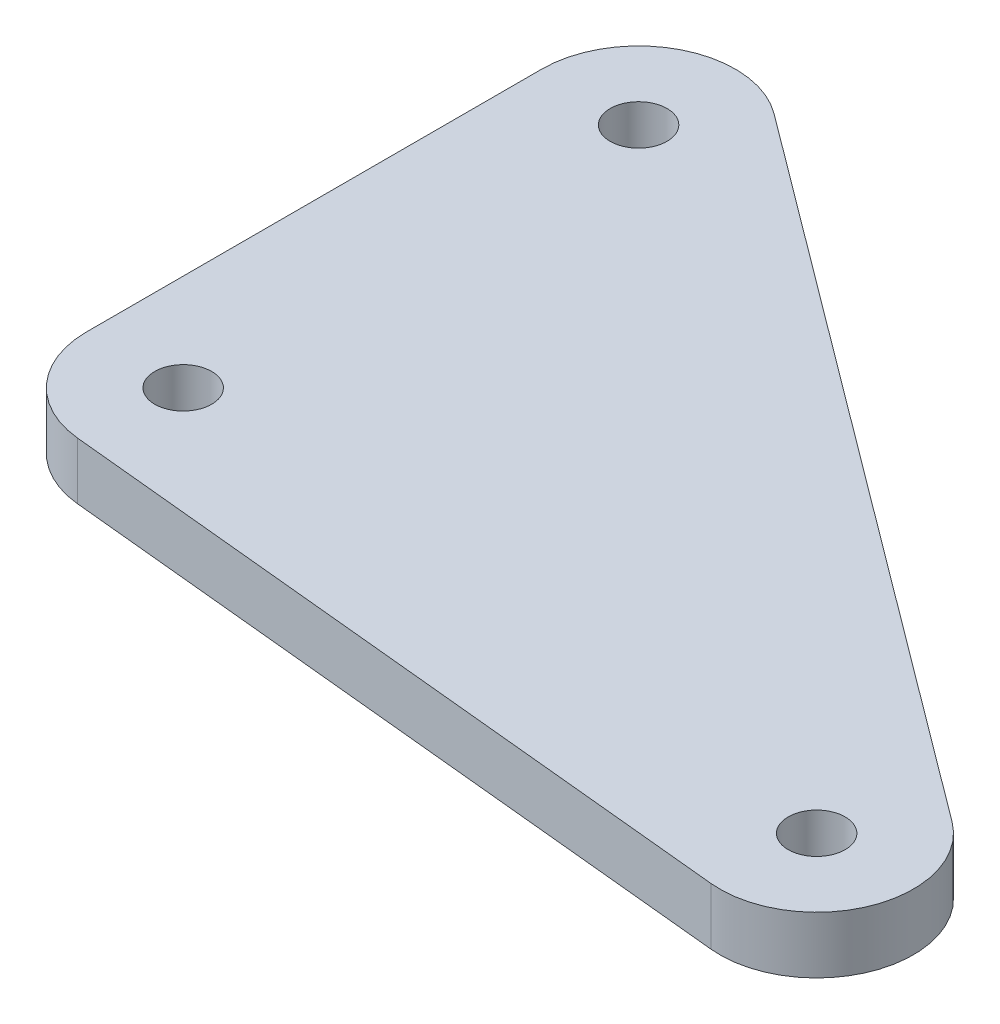
ISO-10303-21;
HEADER;
FILE_DESCRIPTION(('STEP AP214'),'2;1');
FILE_NAME('part.step','',(''),(''),'','','');
FILE_SCHEMA(('AUTOMOTIVE_DESIGN { 1 0 10303 214 1 1 1 1 }'));
ENDSEC;
DATA;
#1=APPLICATION_CONTEXT('core data for automotive mechanical design processes');
#2=APPLICATION_PROTOCOL_DEFINITION('international standard','automotive_design',2000,#1);
#3=PRODUCT_CONTEXT('',#1,'mechanical');
#4=PRODUCT('Part','Part','',(#3));
#5=PRODUCT_RELATED_PRODUCT_CATEGORY('part','',(#4));
#6=PRODUCT_DEFINITION_FORMATION('','',#4);
#7=PRODUCT_DEFINITION_CONTEXT('part definition',#1,'design');
#8=PRODUCT_DEFINITION('design','',#6,#7);
#9=PRODUCT_DEFINITION_SHAPE('','',#8);
#10=(LENGTH_UNIT() NAMED_UNIT(*) SI_UNIT(.MILLI.,.METRE.));
#11=(NAMED_UNIT(*) PLANE_ANGLE_UNIT() SI_UNIT($,.RADIAN.));
#12=(NAMED_UNIT(*) SI_UNIT($,.STERADIAN.) SOLID_ANGLE_UNIT());
#13=UNCERTAINTY_MEASURE_WITH_UNIT(LENGTH_MEASURE(1.E-05),#10,'distance_accuracy_value','');
#14=(GEOMETRIC_REPRESENTATION_CONTEXT(3) GLOBAL_UNCERTAINTY_ASSIGNED_CONTEXT((#13)) GLOBAL_UNIT_ASSIGNED_CONTEXT((#10,
#11,#12)) REPRESENTATION_CONTEXT('',''));
#15=CARTESIAN_POINT('',(0.,0.,0.));
#16=DIRECTION('',(0.,0.,1.));
#17=DIRECTION('',(1.,0.,0.));
#18=AXIS2_PLACEMENT_3D('',#15,#16,#17);
#19=CARTESIAN_POINT('',(0.,2.5,0.));
#20=DIRECTION('',(0.,1.,0.));
#21=DIRECTION('',(0.,0.,1.));
#22=AXIS2_PLACEMENT_3D('',#19,#20,#21);
#23=PLANE('',#22);
#24=CARTESIAN_POINT('',(0.,2.5,20.));
#25=DIRECTION('',(0.,1.,0.));
#26=DIRECTION('',(0.,0.,1.));
#27=AXIS2_PLACEMENT_3D('',#24,#25,#26);
#28=CIRCLE('',#27,1.25);
#29=CARTESIAN_POINT('',(0.,2.5,21.25));
#30=VERTEX_POINT('',#29);
#31=EDGE_CURVE('E184',#30,#30,#28,.T.);
#32=ORIENTED_EDGE('',*,*,#31,.F.);
#33=EDGE_LOOP('',(#32));
#34=FACE_BOUND('',#33,.T.);
#35=CARTESIAN_POINT('',(0.,2.5,0.));
#36=DIRECTION('',(0.,1.,0.));
#37=DIRECTION('',(0.,0.,1.));
#38=AXIS2_PLACEMENT_3D('',#35,#36,#37);
#39=CIRCLE('',#38,4.25);
#40=CARTESIAN_POINT('',(2.54241071428571,2.5,-3.40567875171532));
#41=VERTEX_POINT('',#40);
#42=CARTESIAN_POINT('',(-4.25,2.5,0.));
#43=VERTEX_POINT('',#42);
#44=EDGE_CURVE('E129',#41,#43,#39,.T.);
#45=ORIENTED_EDGE('',*,*,#44,.T.);
#46=DIRECTION('',(0.,0.,1.));
#47=VECTOR('',#46,1.);
#48=CARTESIAN_POINT('',(-4.25,2.5,20.));
#49=LINE('',#48,#47);
#50=CARTESIAN_POINT('',(-4.25,2.5,20.));
#51=VERTEX_POINT('',#50);
#52=EDGE_CURVE('E87',#43,#51,#49,.T.);
#53=ORIENTED_EDGE('',*,*,#52,.T.);
#54=CARTESIAN_POINT('',(0.,2.5,20.));
#55=DIRECTION('',(0.,1.,0.));
#56=DIRECTION('',(0.,0.,1.));
#57=AXIS2_PLACEMENT_3D('',#54,#55,#56);
#58=CIRCLE('',#57,4.25);
#59=CARTESIAN_POINT('',(-0.415574596774195,2.5,24.2296332884206));
#60=VERTEX_POINT('',#59);
#61=EDGE_CURVE('E100',#51,#60,#58,.T.);
#62=ORIENTED_EDGE('',*,*,#61,.T.);
#63=DIRECTION('',(0.995207832569562,0.,0.0977822580645162));
#64=VECTOR('',#63,1.);
#65=CARTESIAN_POINT('',(30.4358682128822,2.5,27.2608832884206));
#66=LINE('',#65,#64);
#67=CARTESIAN_POINT('',(30.4358682128822,2.5,27.2608832884206));
#68=VERTEX_POINT('',#67);
#69=EDGE_CURVE('E94',#60,#68,#66,.T.);
#70=ORIENTED_EDGE('',*,*,#69,.T.);
#71=CARTESIAN_POINT('',(30.8514428096564,2.5,23.03125));
#72=DIRECTION('',(0.,1.,0.));
#73=DIRECTION('',(0.,0.,1.));
#74=AXIS2_PLACEMENT_3D('',#71,#72,#73);
#75=CIRCLE('',#74,4.25);
#76=CARTESIAN_POINT('',(33.3938535239421,2.5,19.6255712482847));
#77=VERTEX_POINT('',#76);
#78=EDGE_CURVE('E98',#68,#77,#75,.T.);
#79=ORIENTED_EDGE('',*,*,#78,.T.);
#80=DIRECTION('',(-0.801336176874192,0.,-0.598214285714286));
#81=VECTOR('',#80,1.);
#82=CARTESIAN_POINT('',(2.54241071428571,2.5,-3.40567875171532));
#83=LINE('',#82,#81);
#84=EDGE_CURVE('E50',#77,#41,#83,.T.);
#85=ORIENTED_EDGE('',*,*,#84,.T.);
#86=EDGE_LOOP('',(#45,#53,#62,#70,#79,#85));
#87=FACE_BOUND('',#86,.T.);
#88=CARTESIAN_POINT('',(0.,2.5,0.));
#89=DIRECTION('',(0.,1.,0.));
#90=DIRECTION('',(0.,0.,1.));
#91=AXIS2_PLACEMENT_3D('',#88,#89,#90);
#92=CIRCLE('',#91,1.25);
#93=CARTESIAN_POINT('',(0.,2.5,1.25));
#94=VERTEX_POINT('',#93);
#95=EDGE_CURVE('E122',#94,#94,#92,.T.);
#96=ORIENTED_EDGE('',*,*,#95,.F.);
#97=EDGE_LOOP('',(#96));
#98=FACE_BOUND('',#97,.T.);
#99=CARTESIAN_POINT('',(30.8514428096564,2.5,23.03125));
#100=DIRECTION('',(0.,1.,0.));
#101=DIRECTION('',(0.,0.,1.));
#102=AXIS2_PLACEMENT_3D('',#99,#100,#101);
#103=CIRCLE('',#102,1.25);
#104=CARTESIAN_POINT('',(30.8514428096564,2.5,24.28125));
#105=VERTEX_POINT('',#104);
#106=EDGE_CURVE('E175',#105,#105,#103,.T.);
#107=ORIENTED_EDGE('',*,*,#106,.F.);
#108=EDGE_LOOP('',(#107));
#109=FACE_BOUND('',#108,.T.);
#110=ADVANCED_FACE('F33',(#34,#87,#98,#109),#23,.T.);
#111=CARTESIAN_POINT('',(0.,0.,0.));
#112=DIRECTION('',(0.,1.,0.));
#113=DIRECTION('',(0.,0.,1.));
#114=AXIS2_PLACEMENT_3D('',#111,#112,#113);
#115=PLANE('',#114);
#116=CARTESIAN_POINT('',(0.,0.,0.));
#117=DIRECTION('',(0.,1.,0.));
#118=DIRECTION('',(0.,0.,1.));
#119=AXIS2_PLACEMENT_3D('',#116,#117,#118);
#120=CIRCLE('',#119,4.25);
#121=CARTESIAN_POINT('',(2.54241071428571,0.,-3.40567875171532));
#122=VERTEX_POINT('',#121);
#123=CARTESIAN_POINT('',(-4.25,0.,0.));
#124=VERTEX_POINT('',#123);
#125=EDGE_CURVE('E118',#122,#124,#120,.T.);
#126=ORIENTED_EDGE('',*,*,#125,.F.);
#127=DIRECTION('',(-0.801336176874192,0.,-0.598214285714286));
#128=VECTOR('',#127,1.);
#129=CARTESIAN_POINT('',(2.54241071428571,0.,-3.40567875171532));
#130=LINE('',#129,#128);
#131=CARTESIAN_POINT('',(33.3938535239421,0.,19.6255712482847));
#132=VERTEX_POINT('',#131);
#133=EDGE_CURVE('E79',#132,#122,#130,.T.);
#134=ORIENTED_EDGE('',*,*,#133,.F.);
#135=CARTESIAN_POINT('',(30.8514428096564,0.,23.03125));
#136=DIRECTION('',(0.,1.,0.));
#137=DIRECTION('',(0.,0.,1.));
#138=AXIS2_PLACEMENT_3D('',#135,#136,#137);
#139=CIRCLE('',#138,4.25);
#140=CARTESIAN_POINT('',(30.4358682128822,0.,27.2608832884206));
#141=VERTEX_POINT('',#140);
#142=EDGE_CURVE('E73',#141,#132,#139,.T.);
#143=ORIENTED_EDGE('',*,*,#142,.F.);
#144=DIRECTION('',(0.995207832569562,0.,0.0977822580645162));
#145=VECTOR('',#144,1.);
#146=CARTESIAN_POINT('',(30.4358682128822,0.,27.2608832884206));
#147=LINE('',#146,#145);
#148=CARTESIAN_POINT('',(-0.415574596774195,0.,24.2296332884206));
#149=VERTEX_POINT('',#148);
#150=EDGE_CURVE('E108',#149,#141,#147,.T.);
#151=ORIENTED_EDGE('',*,*,#150,.F.);
#152=CARTESIAN_POINT('',(0.,0.,20.));
#153=DIRECTION('',(0.,1.,0.));
#154=DIRECTION('',(0.,0.,1.));
#155=AXIS2_PLACEMENT_3D('',#152,#153,#154);
#156=CIRCLE('',#155,4.25);
#157=CARTESIAN_POINT('',(-4.25,0.,20.));
#158=VERTEX_POINT('',#157);
#159=EDGE_CURVE('E124',#158,#149,#156,.T.);
#160=ORIENTED_EDGE('',*,*,#159,.F.);
#161=DIRECTION('',(0.,0.,1.));
#162=VECTOR('',#161,1.);
#163=CARTESIAN_POINT('',(-4.25,0.,20.));
#164=LINE('',#163,#162);
#165=EDGE_CURVE('E121',#124,#158,#164,.T.);
#166=ORIENTED_EDGE('',*,*,#165,.F.);
#167=EDGE_LOOP('',(#126,#134,#143,#151,#160,#166));
#168=FACE_BOUND('',#167,.T.);
#169=CARTESIAN_POINT('',(0.,0.,0.));
#170=DIRECTION('',(0.,1.,0.));
#171=DIRECTION('',(0.,0.,1.));
#172=AXIS2_PLACEMENT_3D('',#169,#170,#171);
#173=CIRCLE('',#172,1.25);
#174=CARTESIAN_POINT('',(0.,0.,1.25));
#175=VERTEX_POINT('',#174);
#176=EDGE_CURVE('E187',#175,#175,#173,.T.);
#177=ORIENTED_EDGE('',*,*,#176,.T.);
#178=EDGE_LOOP('',(#177));
#179=FACE_BOUND('',#178,.T.);
#180=CARTESIAN_POINT('',(0.,0.,20.));
#181=DIRECTION('',(0.,1.,0.));
#182=DIRECTION('',(0.,0.,1.));
#183=AXIS2_PLACEMENT_3D('',#180,#181,#182);
#184=CIRCLE('',#183,1.25);
#185=CARTESIAN_POINT('',(0.,0.,21.25));
#186=VERTEX_POINT('',#185);
#187=EDGE_CURVE('E181',#186,#186,#184,.T.);
#188=ORIENTED_EDGE('',*,*,#187,.T.);
#189=EDGE_LOOP('',(#188));
#190=FACE_BOUND('',#189,.T.);
#191=CARTESIAN_POINT('',(30.8514428096564,0.,23.03125));
#192=DIRECTION('',(0.,1.,0.));
#193=DIRECTION('',(0.,0.,1.));
#194=AXIS2_PLACEMENT_3D('',#191,#192,#193);
#195=CIRCLE('',#194,1.25);
#196=CARTESIAN_POINT('',(30.8514428096564,0.,24.28125));
#197=VERTEX_POINT('',#196);
#198=EDGE_CURVE('E178',#197,#197,#195,.T.);
#199=ORIENTED_EDGE('',*,*,#198,.T.);
#200=EDGE_LOOP('',(#199));
#201=FACE_BOUND('',#200,.T.);
#202=ADVANCED_FACE('F138',(#168,#179,#190,#201),#115,.F.);
#203=CARTESIAN_POINT('',(0.,2.5,0.));
#204=DIRECTION('',(0.,-1.,0.));
#205=DIRECTION('',(0.,0.,-1.));
#206=AXIS2_PLACEMENT_3D('',#203,#204,#205);
#207=CYLINDRICAL_SURFACE('',#206,4.25);
#208=ORIENTED_EDGE('',*,*,#125,.T.);
#209=DIRECTION('',(0.,-1.,0.));
#210=VECTOR('',#209,1.);
#211=CARTESIAN_POINT('',(-4.25,2.5,0.));
#212=LINE('',#211,#210);
#213=EDGE_CURVE('E11',#43,#124,#212,.T.);
#214=ORIENTED_EDGE('',*,*,#213,.F.);
#215=ORIENTED_EDGE('',*,*,#44,.F.);
#216=DIRECTION('',(0.,-1.,0.));
#217=VECTOR('',#216,1.);
#218=CARTESIAN_POINT('',(2.54241071428571,2.5,-3.40567875171532));
#219=LINE('',#218,#217);
#220=EDGE_CURVE('E114',#41,#122,#219,.T.);
#221=ORIENTED_EDGE('',*,*,#220,.T.);
#222=EDGE_LOOP('',(#208,#214,#215,#221));
#223=FACE_BOUND('',#222,.T.);
#224=ADVANCED_FACE('F35',(#223),#207,.T.);
#225=CARTESIAN_POINT('',(-4.25,2.5,20.));
#226=DIRECTION('',(1.,0.,0.));
#227=DIRECTION('',(0.,0.,-1.));
#228=AXIS2_PLACEMENT_3D('',#225,#226,#227);
#229=PLANE('',#228);
#230=ORIENTED_EDGE('',*,*,#165,.T.);
#231=DIRECTION('',(0.,-1.,0.));
#232=VECTOR('',#231,1.);
#233=CARTESIAN_POINT('',(-4.25,2.5,20.));
#234=LINE('',#233,#232);
#235=EDGE_CURVE('E42',#51,#158,#234,.T.);
#236=ORIENTED_EDGE('',*,*,#235,.F.);
#237=ORIENTED_EDGE('',*,*,#52,.F.);
#238=ORIENTED_EDGE('',*,*,#213,.T.);
#239=EDGE_LOOP('',(#230,#236,#237,#238));
#240=FACE_BOUND('',#239,.T.);
#241=ADVANCED_FACE('F237',(#240),#229,.F.);
#242=CARTESIAN_POINT('',(0.,2.5,20.));
#243=DIRECTION('',(0.,-1.,0.));
#244=DIRECTION('',(0.,0.,-1.));
#245=AXIS2_PLACEMENT_3D('',#242,#243,#244);
#246=CYLINDRICAL_SURFACE('',#245,4.25);
#247=ORIENTED_EDGE('',*,*,#159,.T.);
#248=DIRECTION('',(0.,-1.,0.));
#249=VECTOR('',#248,1.);
#250=CARTESIAN_POINT('',(-0.415574596774195,2.5,24.2296332884206));
#251=LINE('',#250,#249);
#252=EDGE_CURVE('E109',#60,#149,#251,.T.);
#253=ORIENTED_EDGE('',*,*,#252,.F.);
#254=ORIENTED_EDGE('',*,*,#61,.F.);
#255=ORIENTED_EDGE('',*,*,#235,.T.);
#256=EDGE_LOOP('',(#247,#253,#254,#255));
#257=FACE_BOUND('',#256,.T.);
#258=ADVANCED_FACE('F135',(#257),#246,.T.);
#259=CARTESIAN_POINT('',(30.4358682128822,2.5,27.2608832884206));
#260=DIRECTION('',(0.0977822580645162,0.,-0.995207832569561));
#261=DIRECTION('',(-0.995207832569562,0.,-0.0977822580645162));
#262=AXIS2_PLACEMENT_3D('',#259,#260,#261);
#263=PLANE('',#262);
#264=ORIENTED_EDGE('',*,*,#150,.T.);
#265=DIRECTION('',(0.,-1.,0.));
#266=VECTOR('',#265,1.);
#267=CARTESIAN_POINT('',(30.4358682128822,2.5,27.2608832884206));
#268=LINE('',#267,#266);
#269=EDGE_CURVE('E105',#68,#141,#268,.T.);
#270=ORIENTED_EDGE('',*,*,#269,.F.);
#271=ORIENTED_EDGE('',*,*,#69,.F.);
#272=ORIENTED_EDGE('',*,*,#252,.T.);
#273=EDGE_LOOP('',(#264,#270,#271,#272));
#274=FACE_BOUND('',#273,.T.);
#275=ADVANCED_FACE('F106',(#274),#263,.F.);
#276=CARTESIAN_POINT('',(30.8514428096564,2.5,23.03125));
#277=DIRECTION('',(0.,-1.,0.));
#278=DIRECTION('',(0.,0.,-1.));
#279=AXIS2_PLACEMENT_3D('',#276,#277,#278);
#280=CYLINDRICAL_SURFACE('',#279,4.25);
#281=ORIENTED_EDGE('',*,*,#142,.T.);
#282=DIRECTION('',(0.,-1.,0.));
#283=VECTOR('',#282,1.);
#284=CARTESIAN_POINT('',(33.3938535239421,2.5,19.6255712482847));
#285=LINE('',#284,#283);
#286=EDGE_CURVE('E110',#77,#132,#285,.T.);
#287=ORIENTED_EDGE('',*,*,#286,.F.);
#288=ORIENTED_EDGE('',*,*,#78,.F.);
#289=ORIENTED_EDGE('',*,*,#269,.T.);
#290=EDGE_LOOP('',(#281,#287,#288,#289));
#291=FACE_BOUND('',#290,.T.);
#292=ADVANCED_FACE('F112',(#291),#280,.T.);
#293=CARTESIAN_POINT('',(2.54241071428571,2.5,-3.40567875171532));
#294=DIRECTION('',(-0.598214285714286,0.,0.801336176874192));
#295=DIRECTION('',(0.801336176874192,0.,0.598214285714286));
#296=AXIS2_PLACEMENT_3D('',#293,#294,#295);
#297=PLANE('',#296);
#298=ORIENTED_EDGE('',*,*,#133,.T.);
#299=ORIENTED_EDGE('',*,*,#220,.F.);
#300=ORIENTED_EDGE('',*,*,#84,.F.);
#301=ORIENTED_EDGE('',*,*,#286,.T.);
#302=EDGE_LOOP('',(#298,#299,#300,#301));
#303=FACE_BOUND('',#302,.T.);
#304=ADVANCED_FACE('F143',(#303),#297,.F.);
#305=CARTESIAN_POINT('',(0.,2.5,0.));
#306=DIRECTION('',(0.,-1.,0.));
#307=DIRECTION('',(0.,0.,-1.));
#308=AXIS2_PLACEMENT_3D('',#305,#306,#307);
#309=CYLINDRICAL_SURFACE('',#308,1.25);
#310=ORIENTED_EDGE('',*,*,#95,.T.);
#311=EDGE_LOOP('',(#310));
#312=FACE_BOUND('',#311,.T.);
#313=ORIENTED_EDGE('',*,*,#176,.F.);
#314=EDGE_LOOP('',(#313));
#315=FACE_BOUND('',#314,.T.);
#316=ADVANCED_FACE('F145',(#312,#315),#309,.F.);
#317=CARTESIAN_POINT('',(0.,2.5,20.));
#318=DIRECTION('',(0.,-1.,0.));
#319=DIRECTION('',(0.,0.,-1.));
#320=AXIS2_PLACEMENT_3D('',#317,#318,#319);
#321=CYLINDRICAL_SURFACE('',#320,1.25);
#322=ORIENTED_EDGE('',*,*,#31,.T.);
#323=EDGE_LOOP('',(#322));
#324=FACE_BOUND('',#323,.T.);
#325=ORIENTED_EDGE('',*,*,#187,.F.);
#326=EDGE_LOOP('',(#325));
#327=FACE_BOUND('',#326,.T.);
#328=ADVANCED_FACE('F151',(#324,#327),#321,.F.);
#329=CARTESIAN_POINT('',(30.8514428096564,2.5,23.03125));
#330=DIRECTION('',(0.,-1.,0.));
#331=DIRECTION('',(0.,0.,-1.));
#332=AXIS2_PLACEMENT_3D('',#329,#330,#331);
#333=CYLINDRICAL_SURFACE('',#332,1.25);
#334=ORIENTED_EDGE('',*,*,#106,.T.);
#335=EDGE_LOOP('',(#334));
#336=FACE_BOUND('',#335,.T.);
#337=ORIENTED_EDGE('',*,*,#198,.F.);
#338=EDGE_LOOP('',(#337));
#339=FACE_BOUND('',#338,.T.);
#340=ADVANCED_FACE('F166',(#336,#339),#333,.F.);
#341=CLOSED_SHELL('',(#110,#202,#224,#241,#258,#275,#292,#304,#316,#328,#340));
#342=MANIFOLD_SOLID_BREP('B2',#341);
#343=ADVANCED_BREP_SHAPE_REPRESENTATION('',(#18,#342),#14);
#344=SHAPE_DEFINITION_REPRESENTATION(#9,#343);
ENDSEC;
END-ISO-10303-21;
